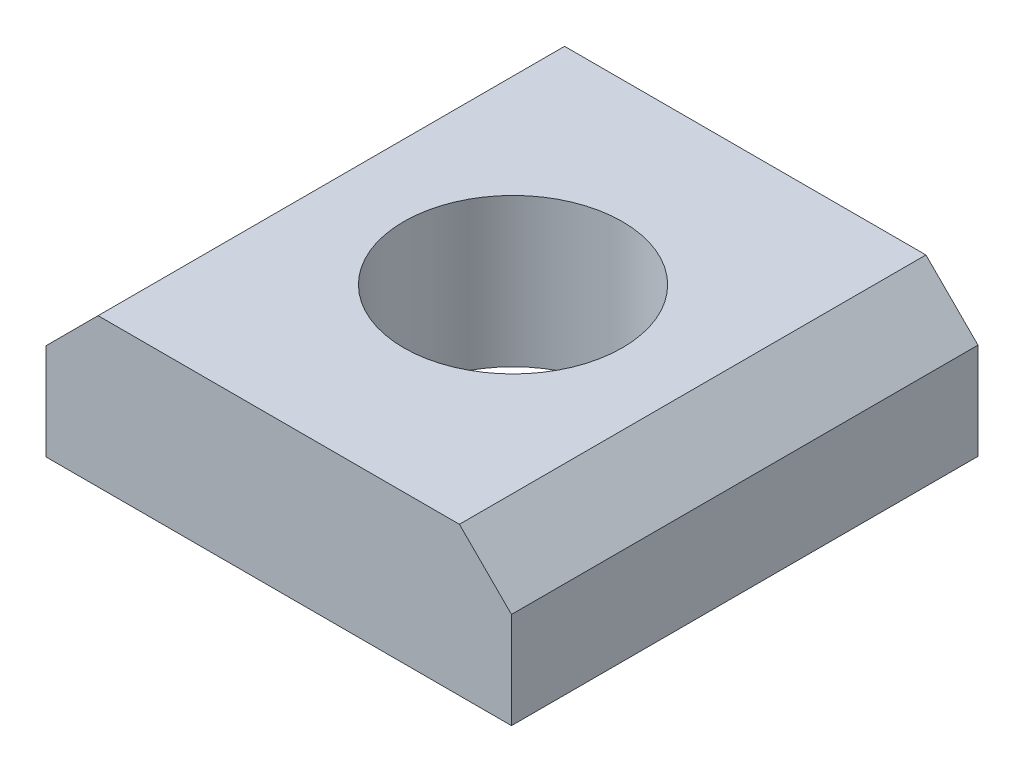
ISO-10303-21;
HEADER;
FILE_DESCRIPTION(('STEP AP214'),'2;1');
FILE_NAME('part.step','',(''),(''),'','','');
FILE_SCHEMA(('AUTOMOTIVE_DESIGN { 1 0 10303 214 1 1 1 1 }'));
ENDSEC;
DATA;
#1=APPLICATION_CONTEXT('core data for automotive mechanical design processes');
#2=APPLICATION_PROTOCOL_DEFINITION('international standard','automotive_design',2000,#1);
#3=PRODUCT_CONTEXT('',#1,'mechanical');
#4=PRODUCT('Part','Part','',(#3));
#5=PRODUCT_RELATED_PRODUCT_CATEGORY('part','',(#4));
#6=PRODUCT_DEFINITION_FORMATION('','',#4);
#7=PRODUCT_DEFINITION_CONTEXT('part definition',#1,'design');
#8=PRODUCT_DEFINITION('design','',#6,#7);
#9=PRODUCT_DEFINITION_SHAPE('','',#8);
#10=(LENGTH_UNIT() NAMED_UNIT(*) SI_UNIT(.MILLI.,.METRE.));
#11=(NAMED_UNIT(*) PLANE_ANGLE_UNIT() SI_UNIT($,.RADIAN.));
#12=(NAMED_UNIT(*) SI_UNIT($,.STERADIAN.) SOLID_ANGLE_UNIT());
#13=UNCERTAINTY_MEASURE_WITH_UNIT(LENGTH_MEASURE(1.E-05),#10,'distance_accuracy_value','');
#14=(GEOMETRIC_REPRESENTATION_CONTEXT(3) GLOBAL_UNCERTAINTY_ASSIGNED_CONTEXT((#13)) GLOBAL_UNIT_ASSIGNED_CONTEXT((#10,
#11,#12)) REPRESENTATION_CONTEXT('',''));
#15=CARTESIAN_POINT('',(0.,0.,0.));
#16=DIRECTION('',(0.,0.,1.));
#17=DIRECTION('',(1.,0.,0.));
#18=AXIS2_PLACEMENT_3D('',#15,#16,#17);
#19=CARTESIAN_POINT('',(-4.47,2.85,-4.46));
#20=DIRECTION('',(1.,0.,0.));
#21=DIRECTION('',(0.,0.,-1.));
#22=AXIS2_PLACEMENT_3D('',#19,#20,#21);
#23=PLANE('',#22);
#24=DIRECTION('',(0.,-1.,0.));
#25=VECTOR('',#24,1.);
#26=CARTESIAN_POINT('',(-4.47,2.85,4.5));
#27=LINE('',#26,#25);
#28=CARTESIAN_POINT('',(-4.47,1.85,4.5));
#29=VERTEX_POINT('',#28);
#30=CARTESIAN_POINT('',(-4.47,0.,4.5));
#31=VERTEX_POINT('',#30);
#32=EDGE_CURVE('E87',#29,#31,#27,.T.);
#33=ORIENTED_EDGE('',*,*,#32,.F.);
#34=DIRECTION('',(0.,0.,-1.));
#35=VECTOR('',#34,1.);
#36=CARTESIAN_POINT('',(-4.47,1.85,-4.46));
#37=LINE('',#36,#35);
#38=CARTESIAN_POINT('',(-4.47,1.85,-4.46));
#39=VERTEX_POINT('',#38);
#40=EDGE_CURVE('E11',#29,#39,#37,.T.);
#41=ORIENTED_EDGE('',*,*,#40,.T.);
#42=DIRECTION('',(0.,-1.,0.));
#43=VECTOR('',#42,1.);
#44=CARTESIAN_POINT('',(-4.47,2.85,-4.46));
#45=LINE('',#44,#43);
#46=CARTESIAN_POINT('',(-4.47,0.,-4.46));
#47=VERTEX_POINT('',#46);
#48=EDGE_CURVE('E107',#39,#47,#45,.T.);
#49=ORIENTED_EDGE('',*,*,#48,.T.);
#50=DIRECTION('',(0.,0.,1.));
#51=VECTOR('',#50,1.);
#52=CARTESIAN_POINT('',(-4.47,0.,-4.46));
#53=LINE('',#52,#51);
#54=EDGE_CURVE('E102',#47,#31,#53,.T.);
#55=ORIENTED_EDGE('',*,*,#54,.T.);
#56=EDGE_LOOP('',(#33,#41,#49,#55));
#57=FACE_BOUND('',#56,.T.);
#58=ADVANCED_FACE('F36',(#57),#23,.F.);
#59=CARTESIAN_POINT('',(-4.47,2.85,4.5));
#60=DIRECTION('',(0.,0.,-1.));
#61=DIRECTION('',(-1.,0.,0.));
#62=AXIS2_PLACEMENT_3D('',#59,#60,#61);
#63=PLANE('',#62);
#64=DIRECTION('',(0.,-1.,0.));
#65=VECTOR('',#64,1.);
#66=CARTESIAN_POINT('',(4.47,2.85,4.5));
#67=LINE('',#66,#65);
#68=CARTESIAN_POINT('',(4.47,1.84999999999999,4.5));
#69=VERTEX_POINT('',#68);
#70=CARTESIAN_POINT('',(4.47,0.,4.5));
#71=VERTEX_POINT('',#70);
#72=EDGE_CURVE('E96',#69,#71,#67,.T.);
#73=ORIENTED_EDGE('',*,*,#72,.F.);
#74=DIRECTION('',(-0.707106781186546,0.707106781186549,0.));
#75=VECTOR('',#74,1.);
#76=CARTESIAN_POINT('',(3.47,2.85,4.5));
#77=LINE('',#76,#75);
#78=CARTESIAN_POINT('',(3.47,2.85,4.5));
#79=VERTEX_POINT('',#78);
#80=EDGE_CURVE('E44',#69,#79,#77,.T.);
#81=ORIENTED_EDGE('',*,*,#80,.T.);
#82=DIRECTION('',(1.,0.,0.));
#83=VECTOR('',#82,1.);
#84=CARTESIAN_POINT('',(-4.47,2.85,4.5));
#85=LINE('',#84,#83);
#86=CARTESIAN_POINT('',(-3.47,2.85,4.5));
#87=VERTEX_POINT('',#86);
#88=EDGE_CURVE('E121',#87,#79,#85,.T.);
#89=ORIENTED_EDGE('',*,*,#88,.F.);
#90=DIRECTION('',(-0.707106781186546,-0.707106781186549,0.));
#91=VECTOR('',#90,1.);
#92=CARTESIAN_POINT('',(-3.47,2.85,4.5));
#93=LINE('',#92,#91);
#94=EDGE_CURVE('E51',#87,#29,#93,.T.);
#95=ORIENTED_EDGE('',*,*,#94,.T.);
#96=ORIENTED_EDGE('',*,*,#32,.T.);
#97=DIRECTION('',(1.,0.,0.));
#98=VECTOR('',#97,1.);
#99=CARTESIAN_POINT('',(-4.47,0.,4.5));
#100=LINE('',#99,#98);
#101=EDGE_CURVE('E90',#31,#71,#100,.T.);
#102=ORIENTED_EDGE('',*,*,#101,.T.);
#103=EDGE_LOOP('',(#73,#81,#89,#95,#96,#102));
#104=FACE_BOUND('',#103,.T.);
#105=ADVANCED_FACE('F89',(#104),#63,.F.);
#106=CARTESIAN_POINT('',(4.47,2.85,-4.46));
#107=DIRECTION('',(-1.,0.,0.));
#108=DIRECTION('',(0.,0.,1.));
#109=AXIS2_PLACEMENT_3D('',#106,#107,#108);
#110=PLANE('',#109);
#111=DIRECTION('',(0.,-1.,0.));
#112=VECTOR('',#111,1.);
#113=CARTESIAN_POINT('',(4.47,2.85,-4.46));
#114=LINE('',#113,#112);
#115=CARTESIAN_POINT('',(4.47,1.84999999999999,-4.46));
#116=VERTEX_POINT('',#115);
#117=CARTESIAN_POINT('',(4.47,0.,-4.46));
#118=VERTEX_POINT('',#117);
#119=EDGE_CURVE('E123',#116,#118,#114,.T.);
#120=ORIENTED_EDGE('',*,*,#119,.F.);
#121=DIRECTION('',(0.,0.,1.));
#122=VECTOR('',#121,1.);
#123=CARTESIAN_POINT('',(4.47,1.84999999999999,4.5));
#124=LINE('',#123,#122);
#125=EDGE_CURVE('E59',#116,#69,#124,.T.);
#126=ORIENTED_EDGE('',*,*,#125,.T.);
#127=ORIENTED_EDGE('',*,*,#72,.T.);
#128=DIRECTION('',(0.,0.,-1.));
#129=VECTOR('',#128,1.);
#130=CARTESIAN_POINT('',(4.47,0.,-4.46));
#131=LINE('',#130,#129);
#132=EDGE_CURVE('E104',#71,#118,#131,.T.);
#133=ORIENTED_EDGE('',*,*,#132,.T.);
#134=EDGE_LOOP('',(#120,#126,#127,#133));
#135=FACE_BOUND('',#134,.T.);
#136=ADVANCED_FACE('F148',(#135),#110,.F.);
#137=CARTESIAN_POINT('',(-4.47,2.85,-4.46));
#138=DIRECTION('',(0.,0.,1.));
#139=DIRECTION('',(1.,0.,0.));
#140=AXIS2_PLACEMENT_3D('',#137,#138,#139);
#141=PLANE('',#140);
#142=DIRECTION('',(-1.,0.,0.));
#143=VECTOR('',#142,1.);
#144=CARTESIAN_POINT('',(-4.47,2.85,-4.46));
#145=LINE('',#144,#143);
#146=CARTESIAN_POINT('',(3.46999999999999,2.85,-4.46));
#147=VERTEX_POINT('',#146);
#148=CARTESIAN_POINT('',(-3.47,2.85,-4.46));
#149=VERTEX_POINT('',#148);
#150=EDGE_CURVE('E115',#147,#149,#145,.T.);
#151=ORIENTED_EDGE('',*,*,#150,.F.);
#152=DIRECTION('',(0.707106781186546,-0.707106781186549,0.));
#153=VECTOR('',#152,1.);
#154=CARTESIAN_POINT('',(3.47,2.85,-4.46));
#155=LINE('',#154,#153);
#156=EDGE_CURVE('E133',#147,#116,#155,.T.);
#157=ORIENTED_EDGE('',*,*,#156,.T.);
#158=ORIENTED_EDGE('',*,*,#119,.T.);
#159=DIRECTION('',(-1.,0.,0.));
#160=VECTOR('',#159,1.);
#161=CARTESIAN_POINT('',(-4.47,0.,-4.46));
#162=LINE('',#161,#160);
#163=EDGE_CURVE('E119',#118,#47,#162,.T.);
#164=ORIENTED_EDGE('',*,*,#163,.T.);
#165=ORIENTED_EDGE('',*,*,#48,.F.);
#166=DIRECTION('',(0.707106781186546,0.707106781186549,0.));
#167=VECTOR('',#166,1.);
#168=CARTESIAN_POINT('',(-3.47,2.85,-4.46));
#169=LINE('',#168,#167);
#170=EDGE_CURVE('E131',#39,#149,#169,.T.);
#171=ORIENTED_EDGE('',*,*,#170,.T.);
#172=EDGE_LOOP('',(#151,#157,#158,#164,#165,#171));
#173=FACE_BOUND('',#172,.T.);
#174=ADVANCED_FACE('F147',(#173),#141,.F.);
#175=CARTESIAN_POINT('',(-4.47,2.85,-4.46));
#176=DIRECTION('',(0.,1.,0.));
#177=DIRECTION('',(0.,0.,1.));
#178=AXIS2_PLACEMENT_3D('',#175,#176,#177);
#179=PLANE('',#178);
#180=CARTESIAN_POINT('',(0.,2.85,0.));
#181=DIRECTION('',(0.,1.,0.));
#182=DIRECTION('',(0.,0.,1.));
#183=AXIS2_PLACEMENT_3D('',#180,#181,#182);
#184=CIRCLE('',#183,2.1);
#185=CARTESIAN_POINT('',(0.,2.85,2.1));
#186=VERTEX_POINT('',#185);
#187=EDGE_CURVE('E112',#186,#186,#184,.T.);
#188=ORIENTED_EDGE('',*,*,#187,.F.);
#189=EDGE_LOOP('',(#188));
#190=FACE_BOUND('',#189,.T.);
#191=ORIENTED_EDGE('',*,*,#88,.T.);
#192=DIRECTION('',(0.,0.,-1.));
#193=VECTOR('',#192,1.);
#194=CARTESIAN_POINT('',(3.47,2.85,-4.46));
#195=LINE('',#194,#193);
#196=EDGE_CURVE('E128',#79,#147,#195,.T.);
#197=ORIENTED_EDGE('',*,*,#196,.T.);
#198=ORIENTED_EDGE('',*,*,#150,.T.);
#199=DIRECTION('',(0.,0.,1.));
#200=VECTOR('',#199,1.);
#201=CARTESIAN_POINT('',(-3.47,2.85,4.5));
#202=LINE('',#201,#200);
#203=EDGE_CURVE('E95',#149,#87,#202,.T.);
#204=ORIENTED_EDGE('',*,*,#203,.T.);
#205=EDGE_LOOP('',(#191,#197,#198,#204));
#206=FACE_BOUND('',#205,.T.);
#207=ADVANCED_FACE('F141',(#190,#206),#179,.T.);
#208=CARTESIAN_POINT('',(-4.47,0.,-4.46));
#209=DIRECTION('',(0.,1.,0.));
#210=DIRECTION('',(0.,0.,1.));
#211=AXIS2_PLACEMENT_3D('',#208,#209,#210);
#212=PLANE('',#211);
#213=CARTESIAN_POINT('',(0.,0.,0.));
#214=DIRECTION('',(0.,1.,0.));
#215=DIRECTION('',(0.,0.,1.));
#216=AXIS2_PLACEMENT_3D('',#213,#214,#215);
#217=CIRCLE('',#216,2.1);
#218=CARTESIAN_POINT('',(0.,0.,2.1));
#219=VERTEX_POINT('',#218);
#220=EDGE_CURVE('E109',#219,#219,#217,.T.);
#221=ORIENTED_EDGE('',*,*,#220,.T.);
#222=EDGE_LOOP('',(#221));
#223=FACE_BOUND('',#222,.T.);
#224=ORIENTED_EDGE('',*,*,#54,.F.);
#225=ORIENTED_EDGE('',*,*,#163,.F.);
#226=ORIENTED_EDGE('',*,*,#132,.F.);
#227=ORIENTED_EDGE('',*,*,#101,.F.);
#228=EDGE_LOOP('',(#224,#225,#226,#227));
#229=FACE_BOUND('',#228,.T.);
#230=ADVANCED_FACE('F100',(#223,#229),#212,.F.);
#231=CARTESIAN_POINT('',(0.,2.85,0.));
#232=DIRECTION('',(0.,1.,0.));
#233=DIRECTION('',(0.,0.,1.));
#234=AXIS2_PLACEMENT_3D('',#231,#232,#233);
#235=CYLINDRICAL_SURFACE('',#234,2.1);
#236=ORIENTED_EDGE('',*,*,#187,.T.);
#237=EDGE_LOOP('',(#236));
#238=FACE_BOUND('',#237,.T.);
#239=ORIENTED_EDGE('',*,*,#220,.F.);
#240=EDGE_LOOP('',(#239));
#241=FACE_BOUND('',#240,.T.);
#242=ADVANCED_FACE('F155',(#238,#241),#235,.F.);
#243=CARTESIAN_POINT('',(3.47,2.85,-4.46));
#244=DIRECTION('',(0.707106781186549,0.707106781186546,0.));
#245=DIRECTION('',(0.,0.,1.));
#246=AXIS2_PLACEMENT_3D('',#243,#244,#245);
#247=PLANE('',#246);
#248=ORIENTED_EDGE('',*,*,#80,.F.);
#249=ORIENTED_EDGE('',*,*,#125,.F.);
#250=ORIENTED_EDGE('',*,*,#156,.F.);
#251=ORIENTED_EDGE('',*,*,#196,.F.);
#252=EDGE_LOOP('',(#248,#249,#250,#251));
#253=FACE_BOUND('',#252,.T.);
#254=ADVANCED_FACE('F145',(#253),#247,.T.);
#255=CARTESIAN_POINT('',(-3.47,2.85,-4.46));
#256=DIRECTION('',(-0.707106781186549,0.707106781186546,0.));
#257=DIRECTION('',(0.,0.,-1.));
#258=AXIS2_PLACEMENT_3D('',#255,#256,#257);
#259=PLANE('',#258);
#260=ORIENTED_EDGE('',*,*,#170,.F.);
#261=ORIENTED_EDGE('',*,*,#40,.F.);
#262=ORIENTED_EDGE('',*,*,#94,.F.);
#263=ORIENTED_EDGE('',*,*,#203,.F.);
#264=EDGE_LOOP('',(#260,#261,#262,#263));
#265=FACE_BOUND('',#264,.T.);
#266=ADVANCED_FACE('F38',(#265),#259,.T.);
#267=CLOSED_SHELL('',(#58,#105,#136,#174,#207,#230,#242,#254,#266));
#268=MANIFOLD_SOLID_BREP('B2',#267);
#269=ADVANCED_BREP_SHAPE_REPRESENTATION('',(#18,#268),#14);
#270=SHAPE_DEFINITION_REPRESENTATION(#9,#269);
ENDSEC;
END-ISO-10303-21;
